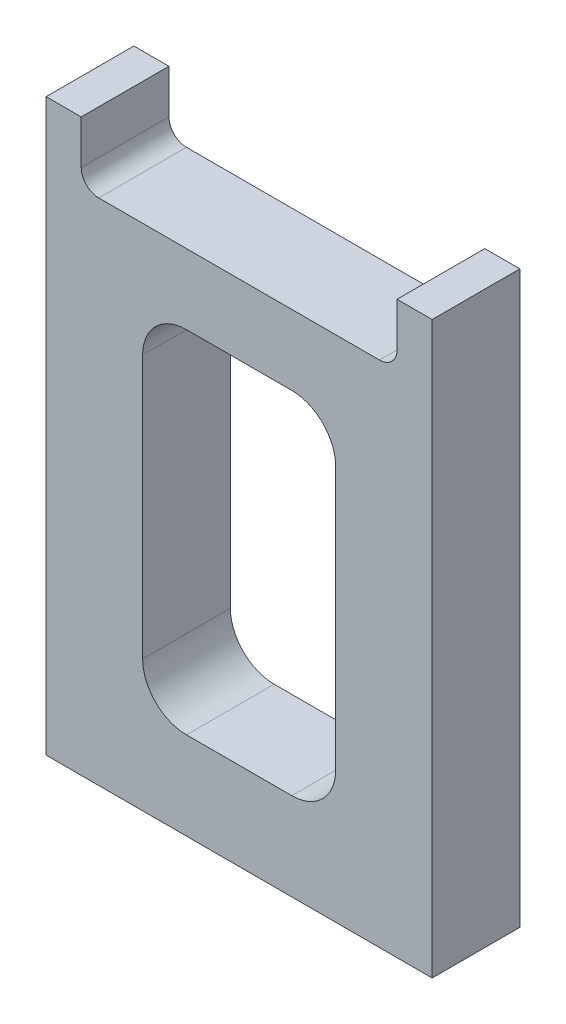
ISO-10303-21;
HEADER;
FILE_DESCRIPTION(('STEP AP214'),'2;1');
FILE_NAME('part.step','',(''),(''),'','','');
FILE_SCHEMA(('AUTOMOTIVE_DESIGN { 1 0 10303 214 1 1 1 1 }'));
ENDSEC;
DATA;
#1=APPLICATION_CONTEXT('core data for automotive mechanical design processes');
#2=APPLICATION_PROTOCOL_DEFINITION('international standard','automotive_design',2000,#1);
#3=PRODUCT_CONTEXT('',#1,'mechanical');
#4=PRODUCT('Part','Part','',(#3));
#5=PRODUCT_RELATED_PRODUCT_CATEGORY('part','',(#4));
#6=PRODUCT_DEFINITION_FORMATION('','',#4);
#7=PRODUCT_DEFINITION_CONTEXT('part definition',#1,'design');
#8=PRODUCT_DEFINITION('design','',#6,#7);
#9=PRODUCT_DEFINITION_SHAPE('','',#8);
#10=(LENGTH_UNIT() NAMED_UNIT(*) SI_UNIT(.MILLI.,.METRE.));
#11=(NAMED_UNIT(*) PLANE_ANGLE_UNIT() SI_UNIT($,.RADIAN.));
#12=(NAMED_UNIT(*) SI_UNIT($,.STERADIAN.) SOLID_ANGLE_UNIT());
#13=UNCERTAINTY_MEASURE_WITH_UNIT(LENGTH_MEASURE(1.E-05),#10,'distance_accuracy_value','');
#14=(GEOMETRIC_REPRESENTATION_CONTEXT(3) GLOBAL_UNCERTAINTY_ASSIGNED_CONTEXT((#13)) GLOBAL_UNIT_ASSIGNED_CONTEXT((#10,
#11,#12)) REPRESENTATION_CONTEXT('',''));
#15=CARTESIAN_POINT('',(0.,0.,0.));
#16=DIRECTION('',(0.,0.,1.));
#17=DIRECTION('',(1.,0.,0.));
#18=AXIS2_PLACEMENT_3D('',#15,#16,#17);
#19=CARTESIAN_POINT('',(22.,0.,10.));
#20=DIRECTION('',(-1.,0.,0.));
#21=DIRECTION('',(0.,0.,1.));
#22=AXIS2_PLACEMENT_3D('',#19,#20,#21);
#23=PLANE('',#22);
#24=DIRECTION('',(0.,1.,0.));
#25=VECTOR('',#24,1.);
#26=CARTESIAN_POINT('',(22.,0.,0.));
#27=LINE('',#26,#25);
#28=CARTESIAN_POINT('',(22.,0.,0.));
#29=VERTEX_POINT('',#28);
#30=CARTESIAN_POINT('',(22.,65.,0.));
#31=VERTEX_POINT('',#30);
#32=EDGE_CURVE('E182',#29,#31,#27,.T.);
#33=ORIENTED_EDGE('',*,*,#32,.T.);
#34=DIRECTION('',(0.,0.,-1.));
#35=VECTOR('',#34,1.);
#36=CARTESIAN_POINT('',(22.,65.,10.));
#37=LINE('',#36,#35);
#38=CARTESIAN_POINT('',(22.,65.,10.));
#39=VERTEX_POINT('',#38);
#40=EDGE_CURVE('E162',#39,#31,#37,.T.);
#41=ORIENTED_EDGE('',*,*,#40,.F.);
#42=DIRECTION('',(0.,1.,0.));
#43=VECTOR('',#42,1.);
#44=CARTESIAN_POINT('',(22.,0.,10.));
#45=LINE('',#44,#43);
#46=CARTESIAN_POINT('',(22.,0.,10.));
#47=VERTEX_POINT('',#46);
#48=EDGE_CURVE('E170',#47,#39,#45,.T.);
#49=ORIENTED_EDGE('',*,*,#48,.F.);
#50=DIRECTION('',(0.,0.,-1.));
#51=VECTOR('',#50,1.);
#52=CARTESIAN_POINT('',(22.,0.,10.));
#53=LINE('',#52,#51);
#54=EDGE_CURVE('E299',#47,#29,#53,.T.);
#55=ORIENTED_EDGE('',*,*,#54,.T.);
#56=EDGE_LOOP('',(#33,#41,#49,#55));
#57=FACE_BOUND('',#56,.T.);
#58=ADVANCED_FACE('F32',(#57),#23,.F.);
#59=CARTESIAN_POINT('',(22.,65.,10.));
#60=DIRECTION('',(0.,-1.,0.));
#61=DIRECTION('',(0.,0.,-1.));
#62=AXIS2_PLACEMENT_3D('',#59,#60,#61);
#63=PLANE('',#62);
#64=DIRECTION('',(-1.,0.,0.));
#65=VECTOR('',#64,1.);
#66=CARTESIAN_POINT('',(22.,65.,0.));
#67=LINE('',#66,#65);
#68=CARTESIAN_POINT('',(18.,65.,0.));
#69=VERTEX_POINT('',#68);
#70=EDGE_CURVE('E301',#31,#69,#67,.T.);
#71=ORIENTED_EDGE('',*,*,#70,.T.);
#72=DIRECTION('',(0.,0.,-1.));
#73=VECTOR('',#72,1.);
#74=CARTESIAN_POINT('',(18.,65.,10.));
#75=LINE('',#74,#73);
#76=CARTESIAN_POINT('',(18.,65.,10.));
#77=VERTEX_POINT('',#76);
#78=EDGE_CURVE('E165',#77,#69,#75,.T.);
#79=ORIENTED_EDGE('',*,*,#78,.F.);
#80=DIRECTION('',(-1.,0.,0.));
#81=VECTOR('',#80,1.);
#82=CARTESIAN_POINT('',(22.,65.,10.));
#83=LINE('',#82,#81);
#84=EDGE_CURVE('E158',#39,#77,#83,.T.);
#85=ORIENTED_EDGE('',*,*,#84,.F.);
#86=ORIENTED_EDGE('',*,*,#40,.T.);
#87=EDGE_LOOP('',(#71,#79,#85,#86));
#88=FACE_BOUND('',#87,.T.);
#89=ADVANCED_FACE('F160',(#88),#63,.F.);
#90=CARTESIAN_POINT('',(18.,65.,10.));
#91=DIRECTION('',(1.,0.,0.));
#92=DIRECTION('',(0.,0.,-1.));
#93=AXIS2_PLACEMENT_3D('',#90,#91,#92);
#94=PLANE('',#93);
#95=DIRECTION('',(0.,-1.,0.));
#96=VECTOR('',#95,1.);
#97=CARTESIAN_POINT('',(18.,65.,0.));
#98=LINE('',#97,#96);
#99=CARTESIAN_POINT('',(18.,60.,0.));
#100=VERTEX_POINT('',#99);
#101=EDGE_CURVE('E303',#69,#100,#98,.T.);
#102=ORIENTED_EDGE('',*,*,#101,.T.);
#103=DIRECTION('',(0.,0.,-1.));
#104=VECTOR('',#103,1.);
#105=CARTESIAN_POINT('',(18.,60.,10.));
#106=LINE('',#105,#104);
#107=CARTESIAN_POINT('',(18.,60.,10.));
#108=VERTEX_POINT('',#107);
#109=EDGE_CURVE('E193',#100,#108,#106,.F.);
#110=ORIENTED_EDGE('',*,*,#109,.T.);
#111=DIRECTION('',(0.,-1.,0.));
#112=VECTOR('',#111,1.);
#113=CARTESIAN_POINT('',(18.,65.,10.));
#114=LINE('',#113,#112);
#115=EDGE_CURVE('E169',#77,#108,#114,.T.);
#116=ORIENTED_EDGE('',*,*,#115,.F.);
#117=ORIENTED_EDGE('',*,*,#78,.T.);
#118=EDGE_LOOP('',(#102,#110,#116,#117));
#119=FACE_BOUND('',#118,.T.);
#120=ADVANCED_FACE('F342',(#119),#94,.F.);
#121=CARTESIAN_POINT('',(18.,58.,10.));
#122=DIRECTION('',(0.,-1.,0.));
#123=DIRECTION('',(0.,0.,-1.));
#124=AXIS2_PLACEMENT_3D('',#121,#122,#123);
#125=PLANE('',#124);
#126=DIRECTION('',(-1.,0.,0.));
#127=VECTOR('',#126,1.);
#128=CARTESIAN_POINT('',(18.,58.,10.));
#129=LINE('',#128,#127);
#130=CARTESIAN_POINT('',(16.,58.,10.));
#131=VERTEX_POINT('',#130);
#132=CARTESIAN_POINT('',(-16.,58.,10.));
#133=VERTEX_POINT('',#132);
#134=EDGE_CURVE('E289',#131,#133,#129,.T.);
#135=ORIENTED_EDGE('',*,*,#134,.F.);
#136=DIRECTION('',(0.,0.,-1.));
#137=VECTOR('',#136,1.);
#138=CARTESIAN_POINT('',(16.,58.,0.));
#139=LINE('',#138,#137);
#140=CARTESIAN_POINT('',(16.,58.,0.));
#141=VERTEX_POINT('',#140);
#142=EDGE_CURVE('E185',#131,#141,#139,.T.);
#143=ORIENTED_EDGE('',*,*,#142,.T.);
#144=DIRECTION('',(-1.,0.,0.));
#145=VECTOR('',#144,1.);
#146=CARTESIAN_POINT('',(18.,58.,0.));
#147=LINE('',#146,#145);
#148=CARTESIAN_POINT('',(-16.,58.,0.));
#149=VERTEX_POINT('',#148);
#150=EDGE_CURVE('E306',#141,#149,#147,.T.);
#151=ORIENTED_EDGE('',*,*,#150,.T.);
#152=DIRECTION('',(0.,0.,-1.));
#153=VECTOR('',#152,1.);
#154=CARTESIAN_POINT('',(-16.,58.,10.));
#155=LINE('',#154,#153);
#156=EDGE_CURVE('E183',#149,#133,#155,.F.);
#157=ORIENTED_EDGE('',*,*,#156,.T.);
#158=EDGE_LOOP('',(#135,#143,#151,#157));
#159=FACE_BOUND('',#158,.T.);
#160=ADVANCED_FACE('F351',(#159),#125,.F.);
#161=CARTESIAN_POINT('',(-18.,65.,10.));
#162=DIRECTION('',(-1.,0.,0.));
#163=DIRECTION('',(0.,0.,1.));
#164=AXIS2_PLACEMENT_3D('',#161,#162,#163);
#165=PLANE('',#164);
#166=DIRECTION('',(0.,1.,0.));
#167=VECTOR('',#166,1.);
#168=CARTESIAN_POINT('',(-18.,65.,10.));
#169=LINE('',#168,#167);
#170=CARTESIAN_POINT('',(-18.,60.,10.));
#171=VERTEX_POINT('',#170);
#172=CARTESIAN_POINT('',(-18.,65.,10.));
#173=VERTEX_POINT('',#172);
#174=EDGE_CURVE('E292',#171,#173,#169,.T.);
#175=ORIENTED_EDGE('',*,*,#174,.F.);
#176=DIRECTION('',(0.,0.,-1.));
#177=VECTOR('',#176,1.);
#178=CARTESIAN_POINT('',(-18.,60.,0.));
#179=LINE('',#178,#177);
#180=CARTESIAN_POINT('',(-18.,60.,0.));
#181=VERTEX_POINT('',#180);
#182=EDGE_CURVE('E195',#171,#181,#179,.T.);
#183=ORIENTED_EDGE('',*,*,#182,.T.);
#184=DIRECTION('',(0.,1.,0.));
#185=VECTOR('',#184,1.);
#186=CARTESIAN_POINT('',(-18.,65.,0.));
#187=LINE('',#186,#185);
#188=CARTESIAN_POINT('',(-18.,65.,0.));
#189=VERTEX_POINT('',#188);
#190=EDGE_CURVE('E309',#181,#189,#187,.T.);
#191=ORIENTED_EDGE('',*,*,#190,.T.);
#192=DIRECTION('',(0.,0.,-1.));
#193=VECTOR('',#192,1.);
#194=CARTESIAN_POINT('',(-18.,65.,10.));
#195=LINE('',#194,#193);
#196=EDGE_CURVE('E187',#173,#189,#195,.T.);
#197=ORIENTED_EDGE('',*,*,#196,.F.);
#198=EDGE_LOOP('',(#175,#183,#191,#197));
#199=FACE_BOUND('',#198,.T.);
#200=ADVANCED_FACE('F357',(#199),#165,.F.);
#201=CARTESIAN_POINT('',(-22.,65.,10.));
#202=DIRECTION('',(0.,-1.,0.));
#203=DIRECTION('',(0.,0.,-1.));
#204=AXIS2_PLACEMENT_3D('',#201,#202,#203);
#205=PLANE('',#204);
#206=DIRECTION('',(-1.,0.,0.));
#207=VECTOR('',#206,1.);
#208=CARTESIAN_POINT('',(-22.,65.,0.));
#209=LINE('',#208,#207);
#210=CARTESIAN_POINT('',(-22.,65.,0.));
#211=VERTEX_POINT('',#210);
#212=EDGE_CURVE('E311',#189,#211,#209,.T.);
#213=ORIENTED_EDGE('',*,*,#212,.T.);
#214=DIRECTION('',(0.,0.,-1.));
#215=VECTOR('',#214,1.);
#216=CARTESIAN_POINT('',(-22.,65.,10.));
#217=LINE('',#216,#215);
#218=CARTESIAN_POINT('',(-22.,65.,10.));
#219=VERTEX_POINT('',#218);
#220=EDGE_CURVE('E320',#219,#211,#217,.T.);
#221=ORIENTED_EDGE('',*,*,#220,.F.);
#222=DIRECTION('',(-1.,0.,0.));
#223=VECTOR('',#222,1.);
#224=CARTESIAN_POINT('',(-22.,65.,10.));
#225=LINE('',#224,#223);
#226=EDGE_CURVE('E294',#173,#219,#225,.T.);
#227=ORIENTED_EDGE('',*,*,#226,.F.);
#228=ORIENTED_EDGE('',*,*,#196,.T.);
#229=EDGE_LOOP('',(#213,#221,#227,#228));
#230=FACE_BOUND('',#229,.T.);
#231=ADVANCED_FACE('F327',(#230),#205,.F.);
#232=CARTESIAN_POINT('',(-22.,0.,10.));
#233=DIRECTION('',(1.,0.,0.));
#234=DIRECTION('',(0.,0.,-1.));
#235=AXIS2_PLACEMENT_3D('',#232,#233,#234);
#236=PLANE('',#235);
#237=DIRECTION('',(0.,-1.,0.));
#238=VECTOR('',#237,1.);
#239=CARTESIAN_POINT('',(-22.,0.,0.));
#240=LINE('',#239,#238);
#241=CARTESIAN_POINT('',(-22.,0.,0.));
#242=VERTEX_POINT('',#241);
#243=EDGE_CURVE('E313',#211,#242,#240,.T.);
#244=ORIENTED_EDGE('',*,*,#243,.T.);
#245=DIRECTION('',(0.,0.,-1.));
#246=VECTOR('',#245,1.);
#247=CARTESIAN_POINT('',(-22.,0.,10.));
#248=LINE('',#247,#246);
#249=CARTESIAN_POINT('',(-22.,0.,10.));
#250=VERTEX_POINT('',#249);
#251=EDGE_CURVE('E317',#250,#242,#248,.T.);
#252=ORIENTED_EDGE('',*,*,#251,.F.);
#253=DIRECTION('',(0.,-1.,0.));
#254=VECTOR('',#253,1.);
#255=CARTESIAN_POINT('',(-22.,0.,10.));
#256=LINE('',#255,#254);
#257=EDGE_CURVE('E296',#219,#250,#256,.T.);
#258=ORIENTED_EDGE('',*,*,#257,.F.);
#259=ORIENTED_EDGE('',*,*,#220,.T.);
#260=EDGE_LOOP('',(#244,#252,#258,#259));
#261=FACE_BOUND('',#260,.T.);
#262=ADVANCED_FACE('F336',(#261),#236,.F.);
#263=CARTESIAN_POINT('',(-22.,0.,10.));
#264=DIRECTION('',(0.,1.,0.));
#265=DIRECTION('',(0.,0.,1.));
#266=AXIS2_PLACEMENT_3D('',#263,#264,#265);
#267=PLANE('',#266);
#268=CARTESIAN_POINT('',(-15.,0.,5.));
#269=DIRECTION('',(0.,-1.,0.));
#270=DIRECTION('',(0.,0.,1.));
#271=AXIS2_PLACEMENT_3D('',#268,#269,#270);
#272=CIRCLE('',#271,2.);
#273=CARTESIAN_POINT('',(-15.,0.,7.));
#274=VERTEX_POINT('',#273);
#275=EDGE_CURVE('E271',#274,#274,#272,.T.);
#276=ORIENTED_EDGE('',*,*,#275,.F.);
#277=EDGE_LOOP('',(#276));
#278=FACE_BOUND('',#277,.T.);
#279=CARTESIAN_POINT('',(15.,0.,5.));
#280=DIRECTION('',(0.,-1.,0.));
#281=DIRECTION('',(0.,0.,-1.));
#282=AXIS2_PLACEMENT_3D('',#279,#280,#281);
#283=CIRCLE('',#282,2.);
#284=CARTESIAN_POINT('',(15.,0.,3.));
#285=VERTEX_POINT('',#284);
#286=EDGE_CURVE('E280',#285,#285,#283,.T.);
#287=ORIENTED_EDGE('',*,*,#286,.F.);
#288=EDGE_LOOP('',(#287));
#289=FACE_BOUND('',#288,.T.);
#290=DIRECTION('',(1.,0.,0.));
#291=VECTOR('',#290,1.);
#292=CARTESIAN_POINT('',(-22.,0.,0.));
#293=LINE('',#292,#291);
#294=EDGE_CURVE('E179',#242,#29,#293,.T.);
#295=ORIENTED_EDGE('',*,*,#294,.T.);
#296=ORIENTED_EDGE('',*,*,#54,.F.);
#297=DIRECTION('',(1.,0.,0.));
#298=VECTOR('',#297,1.);
#299=CARTESIAN_POINT('',(-22.,0.,10.));
#300=LINE('',#299,#298);
#301=EDGE_CURVE('E175',#250,#47,#300,.T.);
#302=ORIENTED_EDGE('',*,*,#301,.F.);
#303=ORIENTED_EDGE('',*,*,#251,.T.);
#304=EDGE_LOOP('',(#295,#296,#302,#303));
#305=FACE_BOUND('',#304,.T.);
#306=ADVANCED_FACE('F339',(#278,#289,#305),#267,.F.);
#307=CARTESIAN_POINT('',(0.,0.,10.));
#308=DIRECTION('',(0.,0.,1.));
#309=DIRECTION('',(1.,0.,0.));
#310=AXIS2_PLACEMENT_3D('',#307,#308,#309);
#311=PLANE('',#310);
#312=DIRECTION('',(1.,0.,0.));
#313=VECTOR('',#312,1.);
#314=CARTESIAN_POINT('',(11.,50.,10.));
#315=LINE('',#314,#313);
#316=CARTESIAN_POINT('',(-6.,50.,10.));
#317=VERTEX_POINT('',#316);
#318=CARTESIAN_POINT('',(6.,50.,10.));
#319=VERTEX_POINT('',#318);
#320=EDGE_CURVE('E260',#317,#319,#315,.T.);
#321=ORIENTED_EDGE('',*,*,#320,.T.);
#322=CARTESIAN_POINT('',(6.,45.,10.));
#323=DIRECTION('',(0.,0.,1.));
#324=DIRECTION('',(1.,0.,0.));
#325=AXIS2_PLACEMENT_3D('',#322,#323,#324);
#326=CIRCLE('',#325,5.);
#327=CARTESIAN_POINT('',(11.,45.,10.));
#328=VERTEX_POINT('',#327);
#329=EDGE_CURVE('E11',#319,#328,#326,.F.);
#330=ORIENTED_EDGE('',*,*,#329,.T.);
#331=DIRECTION('',(0.,-1.,0.));
#332=VECTOR('',#331,1.);
#333=CARTESIAN_POINT('',(11.,50.,10.));
#334=LINE('',#333,#332);
#335=CARTESIAN_POINT('',(11.,15.,10.));
#336=VERTEX_POINT('',#335);
#337=EDGE_CURVE('E253',#328,#336,#334,.T.);
#338=ORIENTED_EDGE('',*,*,#337,.T.);
#339=CARTESIAN_POINT('',(6.,15.,10.));
#340=DIRECTION('',(0.,0.,1.));
#341=DIRECTION('',(1.,0.,0.));
#342=AXIS2_PLACEMENT_3D('',#339,#340,#341);
#343=CIRCLE('',#342,5.);
#344=CARTESIAN_POINT('',(6.,10.,10.));
#345=VERTEX_POINT('',#344);
#346=EDGE_CURVE('E227',#336,#345,#343,.F.);
#347=ORIENTED_EDGE('',*,*,#346,.T.);
#348=DIRECTION('',(-1.,0.,0.));
#349=VECTOR('',#348,1.);
#350=CARTESIAN_POINT('',(11.,10.,10.));
#351=LINE('',#350,#349);
#352=CARTESIAN_POINT('',(-6.,10.,10.));
#353=VERTEX_POINT('',#352);
#354=EDGE_CURVE('E264',#345,#353,#351,.T.);
#355=ORIENTED_EDGE('',*,*,#354,.T.);
#356=CARTESIAN_POINT('',(-6.,15.,10.));
#357=DIRECTION('',(0.,0.,1.));
#358=DIRECTION('',(1.,0.,0.));
#359=AXIS2_PLACEMENT_3D('',#356,#357,#358);
#360=CIRCLE('',#359,5.);
#361=CARTESIAN_POINT('',(-11.,15.,10.));
#362=VERTEX_POINT('',#361);
#363=EDGE_CURVE('E54',#353,#362,#360,.F.);
#364=ORIENTED_EDGE('',*,*,#363,.T.);
#365=DIRECTION('',(0.,1.,0.));
#366=VECTOR('',#365,1.);
#367=CARTESIAN_POINT('',(-11.,50.,10.));
#368=LINE('',#367,#366);
#369=CARTESIAN_POINT('',(-11.,45.,10.));
#370=VERTEX_POINT('',#369);
#371=EDGE_CURVE('E266',#362,#370,#368,.T.);
#372=ORIENTED_EDGE('',*,*,#371,.T.);
#373=CARTESIAN_POINT('',(-6.,45.,10.));
#374=DIRECTION('',(0.,0.,1.));
#375=DIRECTION('',(1.,0.,0.));
#376=AXIS2_PLACEMENT_3D('',#373,#374,#375);
#377=CIRCLE('',#376,5.);
#378=EDGE_CURVE('E231',#370,#317,#377,.F.);
#379=ORIENTED_EDGE('',*,*,#378,.T.);
#380=EDGE_LOOP('',(#321,#330,#338,#347,#355,#364,#372,#379));
#381=FACE_BOUND('',#380,.T.);
#382=ORIENTED_EDGE('',*,*,#48,.T.);
#383=ORIENTED_EDGE('',*,*,#84,.T.);
#384=ORIENTED_EDGE('',*,*,#115,.T.);
#385=CARTESIAN_POINT('',(16.,60.,10.));
#386=DIRECTION('',(0.,0.,1.));
#387=DIRECTION('',(1.,0.,0.));
#388=AXIS2_PLACEMENT_3D('',#385,#386,#387);
#389=CIRCLE('',#388,2.);
#390=EDGE_CURVE('E200',#108,#131,#389,.F.);
#391=ORIENTED_EDGE('',*,*,#390,.T.);
#392=ORIENTED_EDGE('',*,*,#134,.T.);
#393=CARTESIAN_POINT('',(-16.,60.,10.));
#394=DIRECTION('',(0.,0.,1.));
#395=DIRECTION('',(1.,0.,0.));
#396=AXIS2_PLACEMENT_3D('',#393,#394,#395);
#397=CIRCLE('',#396,2.);
#398=EDGE_CURVE('E204',#133,#171,#397,.F.);
#399=ORIENTED_EDGE('',*,*,#398,.T.);
#400=ORIENTED_EDGE('',*,*,#174,.T.);
#401=ORIENTED_EDGE('',*,*,#226,.T.);
#402=ORIENTED_EDGE('',*,*,#257,.T.);
#403=ORIENTED_EDGE('',*,*,#301,.T.);
#404=EDGE_LOOP('',(#382,#383,#384,#391,#392,#399,#400,#401,#402,#403));
#405=FACE_BOUND('',#404,.T.);
#406=ADVANCED_FACE('F173',(#381,#405),#311,.T.);
#407=CARTESIAN_POINT('',(0.,0.,0.));
#408=DIRECTION('',(0.,0.,1.));
#409=DIRECTION('',(1.,0.,0.));
#410=AXIS2_PLACEMENT_3D('',#407,#408,#409);
#411=PLANE('',#410);
#412=DIRECTION('',(-1.,0.,0.));
#413=VECTOR('',#412,1.);
#414=CARTESIAN_POINT('',(11.,10.,0.));
#415=LINE('',#414,#413);
#416=CARTESIAN_POINT('',(6.,10.,0.));
#417=VERTEX_POINT('',#416);
#418=CARTESIAN_POINT('',(-6.,10.,0.));
#419=VERTEX_POINT('',#418);
#420=EDGE_CURVE('E273',#417,#419,#415,.T.);
#421=ORIENTED_EDGE('',*,*,#420,.F.);
#422=CARTESIAN_POINT('',(6.,15.,0.));
#423=DIRECTION('',(0.,0.,1.));
#424=DIRECTION('',(1.,0.,0.));
#425=AXIS2_PLACEMENT_3D('',#422,#423,#424);
#426=CIRCLE('',#425,5.);
#427=CARTESIAN_POINT('',(11.,15.,0.));
#428=VERTEX_POINT('',#427);
#429=EDGE_CURVE('E225',#417,#428,#426,.T.);
#430=ORIENTED_EDGE('',*,*,#429,.T.);
#431=DIRECTION('',(0.,-1.,0.));
#432=VECTOR('',#431,1.);
#433=CARTESIAN_POINT('',(11.,50.,0.));
#434=LINE('',#433,#432);
#435=CARTESIAN_POINT('',(11.,45.,0.));
#436=VERTEX_POINT('',#435);
#437=EDGE_CURVE('E244',#436,#428,#434,.T.);
#438=ORIENTED_EDGE('',*,*,#437,.F.);
#439=CARTESIAN_POINT('',(6.,45.,0.));
#440=DIRECTION('',(0.,0.,1.));
#441=DIRECTION('',(1.,0.,0.));
#442=AXIS2_PLACEMENT_3D('',#439,#440,#441);
#443=CIRCLE('',#442,5.);
#444=CARTESIAN_POINT('',(6.,50.,0.));
#445=VERTEX_POINT('',#444);
#446=EDGE_CURVE('E40',#436,#445,#443,.T.);
#447=ORIENTED_EDGE('',*,*,#446,.T.);
#448=DIRECTION('',(1.,0.,0.));
#449=VECTOR('',#448,1.);
#450=CARTESIAN_POINT('',(11.,50.,0.));
#451=LINE('',#450,#449);
#452=CARTESIAN_POINT('',(-6.,50.,0.));
#453=VERTEX_POINT('',#452);
#454=EDGE_CURVE('E242',#453,#445,#451,.T.);
#455=ORIENTED_EDGE('',*,*,#454,.F.);
#456=CARTESIAN_POINT('',(-6.,45.,0.));
#457=DIRECTION('',(0.,0.,1.));
#458=DIRECTION('',(1.,0.,0.));
#459=AXIS2_PLACEMENT_3D('',#456,#457,#458);
#460=CIRCLE('',#459,5.);
#461=CARTESIAN_POINT('',(-11.,45.,0.));
#462=VERTEX_POINT('',#461);
#463=EDGE_CURVE('E229',#453,#462,#460,.T.);
#464=ORIENTED_EDGE('',*,*,#463,.T.);
#465=DIRECTION('',(0.,1.,0.));
#466=VECTOR('',#465,1.);
#467=CARTESIAN_POINT('',(-11.,50.,0.));
#468=LINE('',#467,#466);
#469=CARTESIAN_POINT('',(-11.,15.,0.));
#470=VERTEX_POINT('',#469);
#471=EDGE_CURVE('E254',#470,#462,#468,.T.);
#472=ORIENTED_EDGE('',*,*,#471,.F.);
#473=CARTESIAN_POINT('',(-6.,15.,0.));
#474=DIRECTION('',(0.,0.,1.));
#475=DIRECTION('',(1.,0.,0.));
#476=AXIS2_PLACEMENT_3D('',#473,#474,#475);
#477=CIRCLE('',#476,5.);
#478=EDGE_CURVE('E233',#470,#419,#477,.T.);
#479=ORIENTED_EDGE('',*,*,#478,.T.);
#480=EDGE_LOOP('',(#421,#430,#438,#447,#455,#464,#472,#479));
#481=FACE_BOUND('',#480,.T.);
#482=ORIENTED_EDGE('',*,*,#32,.F.);
#483=ORIENTED_EDGE('',*,*,#294,.F.);
#484=ORIENTED_EDGE('',*,*,#243,.F.);
#485=ORIENTED_EDGE('',*,*,#212,.F.);
#486=ORIENTED_EDGE('',*,*,#190,.F.);
#487=CARTESIAN_POINT('',(-16.,60.,0.));
#488=DIRECTION('',(0.,0.,1.));
#489=DIRECTION('',(1.,0.,0.));
#490=AXIS2_PLACEMENT_3D('',#487,#488,#489);
#491=CIRCLE('',#490,2.);
#492=EDGE_CURVE('E202',#181,#149,#491,.T.);
#493=ORIENTED_EDGE('',*,*,#492,.T.);
#494=ORIENTED_EDGE('',*,*,#150,.F.);
#495=CARTESIAN_POINT('',(16.,60.,0.));
#496=DIRECTION('',(0.,0.,1.));
#497=DIRECTION('',(1.,0.,0.));
#498=AXIS2_PLACEMENT_3D('',#495,#496,#497);
#499=CIRCLE('',#498,2.);
#500=EDGE_CURVE('E198',#141,#100,#499,.T.);
#501=ORIENTED_EDGE('',*,*,#500,.T.);
#502=ORIENTED_EDGE('',*,*,#101,.F.);
#503=ORIENTED_EDGE('',*,*,#70,.F.);
#504=EDGE_LOOP('',(#482,#483,#484,#485,#486,#493,#494,#501,#502,#503));
#505=FACE_BOUND('',#504,.T.);
#506=ADVANCED_FACE('F240',(#481,#505),#411,.F.);
#507=CARTESIAN_POINT('',(15.,10.,5.));
#508=DIRECTION('',(0.,-1.,0.));
#509=DIRECTION('',(0.,0.,-1.));
#510=AXIS2_PLACEMENT_3D('',#507,#508,#509);
#511=CYLINDRICAL_SURFACE('',#510,2.);
#512=CARTESIAN_POINT('',(15.,10.,5.));
#513=DIRECTION('',(0.,-1.,0.));
#514=DIRECTION('',(0.,0.,-1.));
#515=AXIS2_PLACEMENT_3D('',#512,#513,#514);
#516=CIRCLE('',#515,2.);
#517=CARTESIAN_POINT('',(15.,10.,3.));
#518=VERTEX_POINT('',#517);
#519=EDGE_CURVE('E283',#518,#518,#516,.T.);
#520=ORIENTED_EDGE('',*,*,#519,.F.);
#521=EDGE_LOOP('',(#520));
#522=FACE_BOUND('',#521,.T.);
#523=ORIENTED_EDGE('',*,*,#286,.T.);
#524=EDGE_LOOP('',(#523));
#525=FACE_BOUND('',#524,.T.);
#526=ADVANCED_FACE('F421',(#522,#525),#511,.F.);
#527=CARTESIAN_POINT('',(15.,10.,5.));
#528=DIRECTION('',(0.,-1.,0.));
#529=DIRECTION('',(0.,0.,-1.));
#530=AXIS2_PLACEMENT_3D('',#527,#528,#529);
#531=PLANE('',#530);
#532=ORIENTED_EDGE('',*,*,#519,.T.);
#533=EDGE_LOOP('',(#532));
#534=FACE_BOUND('',#533,.T.);
#535=ADVANCED_FACE('F417',(#534),#531,.T.);
#536=CARTESIAN_POINT('',(-15.,10.,5.));
#537=DIRECTION('',(0.,-1.,0.));
#538=DIRECTION('',(0.,0.,-1.));
#539=AXIS2_PLACEMENT_3D('',#536,#537,#538);
#540=CYLINDRICAL_SURFACE('',#539,2.);
#541=CARTESIAN_POINT('',(-15.,10.,5.));
#542=DIRECTION('',(0.,-1.,0.));
#543=DIRECTION('',(0.,0.,1.));
#544=AXIS2_PLACEMENT_3D('',#541,#542,#543);
#545=CIRCLE('',#544,2.);
#546=CARTESIAN_POINT('',(-15.,10.,7.));
#547=VERTEX_POINT('',#546);
#548=EDGE_CURVE('E277',#547,#547,#545,.T.);
#549=ORIENTED_EDGE('',*,*,#548,.F.);
#550=EDGE_LOOP('',(#549));
#551=FACE_BOUND('',#550,.T.);
#552=ORIENTED_EDGE('',*,*,#275,.T.);
#553=EDGE_LOOP('',(#552));
#554=FACE_BOUND('',#553,.T.);
#555=ADVANCED_FACE('F413',(#551,#554),#540,.F.);
#556=CARTESIAN_POINT('',(-15.,10.,5.));
#557=DIRECTION('',(0.,1.,0.));
#558=DIRECTION('',(0.,0.,1.));
#559=AXIS2_PLACEMENT_3D('',#556,#557,#558);
#560=PLANE('',#559);
#561=ORIENTED_EDGE('',*,*,#548,.T.);
#562=EDGE_LOOP('',(#561));
#563=FACE_BOUND('',#562,.T.);
#564=ADVANCED_FACE('F376',(#563),#560,.F.);
#565=CARTESIAN_POINT('',(16.,60.,10.));
#566=DIRECTION('',(0.,0.,1.));
#567=DIRECTION('',(1.,0.,0.));
#568=AXIS2_PLACEMENT_3D('',#565,#566,#567);
#569=CYLINDRICAL_SURFACE('',#568,2.);
#570=ORIENTED_EDGE('',*,*,#390,.F.);
#571=ORIENTED_EDGE('',*,*,#109,.F.);
#572=ORIENTED_EDGE('',*,*,#500,.F.);
#573=ORIENTED_EDGE('',*,*,#142,.F.);
#574=EDGE_LOOP('',(#570,#571,#572,#573));
#575=FACE_BOUND('',#574,.T.);
#576=ADVANCED_FACE('F348',(#575),#569,.F.);
#577=CARTESIAN_POINT('',(-16.,60.,10.));
#578=DIRECTION('',(0.,0.,1.));
#579=DIRECTION('',(1.,0.,0.));
#580=AXIS2_PLACEMENT_3D('',#577,#578,#579);
#581=CYLINDRICAL_SURFACE('',#580,2.);
#582=ORIENTED_EDGE('',*,*,#398,.F.);
#583=ORIENTED_EDGE('',*,*,#156,.F.);
#584=ORIENTED_EDGE('',*,*,#492,.F.);
#585=ORIENTED_EDGE('',*,*,#182,.F.);
#586=EDGE_LOOP('',(#582,#583,#584,#585));
#587=FACE_BOUND('',#586,.T.);
#588=ADVANCED_FACE('F356',(#587),#581,.F.);
#589=CARTESIAN_POINT('',(11.,50.,10.));
#590=DIRECTION('',(1.,0.,0.));
#591=DIRECTION('',(0.,1.,0.));
#592=AXIS2_PLACEMENT_3D('',#589,#590,#591);
#593=PLANE('',#592);
#594=ORIENTED_EDGE('',*,*,#437,.T.);
#595=DIRECTION('',(0.,0.,-1.));
#596=VECTOR('',#595,1.);
#597=CARTESIAN_POINT('',(11.,15.,10.));
#598=LINE('',#597,#596);
#599=EDGE_CURVE('E214',#428,#336,#598,.F.);
#600=ORIENTED_EDGE('',*,*,#599,.T.);
#601=ORIENTED_EDGE('',*,*,#337,.F.);
#602=DIRECTION('',(0.,0.,-1.));
#603=VECTOR('',#602,1.);
#604=CARTESIAN_POINT('',(11.,45.,0.));
#605=LINE('',#604,#603);
#606=EDGE_CURVE('E211',#328,#436,#605,.T.);
#607=ORIENTED_EDGE('',*,*,#606,.T.);
#608=EDGE_LOOP('',(#594,#600,#601,#607));
#609=FACE_BOUND('',#608,.T.);
#610=ADVANCED_FACE('F262',(#609),#593,.F.);
#611=CARTESIAN_POINT('',(11.,50.,10.));
#612=DIRECTION('',(0.,1.,0.));
#613=DIRECTION('',(0.,0.,1.));
#614=AXIS2_PLACEMENT_3D('',#611,#612,#613);
#615=PLANE('',#614);
#616=ORIENTED_EDGE('',*,*,#320,.F.);
#617=DIRECTION('',(0.,0.,-1.));
#618=VECTOR('',#617,1.);
#619=CARTESIAN_POINT('',(-6.,50.,0.));
#620=LINE('',#619,#618);
#621=EDGE_CURVE('E218',#317,#453,#620,.T.);
#622=ORIENTED_EDGE('',*,*,#621,.T.);
#623=ORIENTED_EDGE('',*,*,#454,.T.);
#624=DIRECTION('',(0.,0.,-1.));
#625=VECTOR('',#624,1.);
#626=CARTESIAN_POINT('',(6.,50.,10.));
#627=LINE('',#626,#625);
#628=EDGE_CURVE('E216',#445,#319,#627,.F.);
#629=ORIENTED_EDGE('',*,*,#628,.T.);
#630=EDGE_LOOP('',(#616,#622,#623,#629));
#631=FACE_BOUND('',#630,.T.);
#632=ADVANCED_FACE('F250',(#631),#615,.F.);
#633=CARTESIAN_POINT('',(-11.,50.,10.));
#634=DIRECTION('',(-1.,0.,0.));
#635=DIRECTION('',(0.,0.,1.));
#636=AXIS2_PLACEMENT_3D('',#633,#634,#635);
#637=PLANE('',#636);
#638=ORIENTED_EDGE('',*,*,#471,.T.);
#639=DIRECTION('',(0.,0.,-1.));
#640=VECTOR('',#639,1.);
#641=CARTESIAN_POINT('',(-11.,45.,10.));
#642=LINE('',#641,#640);
#643=EDGE_CURVE('E47',#462,#370,#642,.F.);
#644=ORIENTED_EDGE('',*,*,#643,.T.);
#645=ORIENTED_EDGE('',*,*,#371,.F.);
#646=DIRECTION('',(0.,0.,-1.));
#647=VECTOR('',#646,1.);
#648=CARTESIAN_POINT('',(-11.,15.,0.));
#649=LINE('',#648,#647);
#650=EDGE_CURVE('E221',#362,#470,#649,.T.);
#651=ORIENTED_EDGE('',*,*,#650,.T.);
#652=EDGE_LOOP('',(#638,#644,#645,#651));
#653=FACE_BOUND('',#652,.T.);
#654=ADVANCED_FACE('F396',(#653),#637,.F.);
#655=CARTESIAN_POINT('',(11.,10.,10.));
#656=DIRECTION('',(0.,-1.,0.));
#657=DIRECTION('',(0.,0.,-1.));
#658=AXIS2_PLACEMENT_3D('',#655,#656,#657);
#659=PLANE('',#658);
#660=ORIENTED_EDGE('',*,*,#354,.F.);
#661=DIRECTION('',(0.,0.,-1.));
#662=VECTOR('',#661,1.);
#663=CARTESIAN_POINT('',(6.,10.,0.));
#664=LINE('',#663,#662);
#665=EDGE_CURVE('E208',#345,#417,#664,.T.);
#666=ORIENTED_EDGE('',*,*,#665,.T.);
#667=ORIENTED_EDGE('',*,*,#420,.T.);
#668=DIRECTION('',(0.,0.,-1.));
#669=VECTOR('',#668,1.);
#670=CARTESIAN_POINT('',(-6.,10.,10.));
#671=LINE('',#670,#669);
#672=EDGE_CURVE('E206',#419,#353,#671,.F.);
#673=ORIENTED_EDGE('',*,*,#672,.T.);
#674=EDGE_LOOP('',(#660,#666,#667,#673));
#675=FACE_BOUND('',#674,.T.);
#676=ADVANCED_FACE('F383',(#675),#659,.F.);
#677=CARTESIAN_POINT('',(6.,15.,10.));
#678=DIRECTION('',(0.,0.,1.));
#679=DIRECTION('',(1.,0.,0.));
#680=AXIS2_PLACEMENT_3D('',#677,#678,#679);
#681=CYLINDRICAL_SURFACE('',#680,5.);
#682=ORIENTED_EDGE('',*,*,#346,.F.);
#683=ORIENTED_EDGE('',*,*,#599,.F.);
#684=ORIENTED_EDGE('',*,*,#429,.F.);
#685=ORIENTED_EDGE('',*,*,#665,.F.);
#686=EDGE_LOOP('',(#682,#683,#684,#685));
#687=FACE_BOUND('',#686,.T.);
#688=ADVANCED_FACE('F379',(#687),#681,.F.);
#689=CARTESIAN_POINT('',(-6.,45.,10.));
#690=DIRECTION('',(0.,0.,1.));
#691=DIRECTION('',(1.,0.,0.));
#692=AXIS2_PLACEMENT_3D('',#689,#690,#691);
#693=CYLINDRICAL_SURFACE('',#692,5.);
#694=ORIENTED_EDGE('',*,*,#378,.F.);
#695=ORIENTED_EDGE('',*,*,#643,.F.);
#696=ORIENTED_EDGE('',*,*,#463,.F.);
#697=ORIENTED_EDGE('',*,*,#621,.F.);
#698=EDGE_LOOP('',(#694,#695,#696,#697));
#699=FACE_BOUND('',#698,.T.);
#700=ADVANCED_FACE('F382',(#699),#693,.F.);
#701=CARTESIAN_POINT('',(-6.,15.,10.));
#702=DIRECTION('',(0.,0.,1.));
#703=DIRECTION('',(1.,0.,0.));
#704=AXIS2_PLACEMENT_3D('',#701,#702,#703);
#705=CYLINDRICAL_SURFACE('',#704,5.);
#706=ORIENTED_EDGE('',*,*,#363,.F.);
#707=ORIENTED_EDGE('',*,*,#672,.F.);
#708=ORIENTED_EDGE('',*,*,#478,.F.);
#709=ORIENTED_EDGE('',*,*,#650,.F.);
#710=EDGE_LOOP('',(#706,#707,#708,#709));
#711=FACE_BOUND('',#710,.T.);
#712=ADVANCED_FACE('F386',(#711),#705,.F.);
#713=CARTESIAN_POINT('',(6.,45.,10.));
#714=DIRECTION('',(0.,0.,1.));
#715=DIRECTION('',(1.,0.,0.));
#716=AXIS2_PLACEMENT_3D('',#713,#714,#715);
#717=CYLINDRICAL_SURFACE('',#716,5.);
#718=ORIENTED_EDGE('',*,*,#329,.F.);
#719=ORIENTED_EDGE('',*,*,#628,.F.);
#720=ORIENTED_EDGE('',*,*,#446,.F.);
#721=ORIENTED_EDGE('',*,*,#606,.F.);
#722=EDGE_LOOP('',(#718,#719,#720,#721));
#723=FACE_BOUND('',#722,.T.);
#724=ADVANCED_FACE('F34',(#723),#717,.F.);
#725=CLOSED_SHELL('',(#58,#89,#120,#160,#200,#231,#262,#306,#406,#506,#526,#535,#555,#564,#576,
#588,#610,#632,#654,#676,#688,#700,#712,#724));
#726=MANIFOLD_SOLID_BREP('B2',#725);
#727=ADVANCED_BREP_SHAPE_REPRESENTATION('',(#18,#726),#14);
#728=SHAPE_DEFINITION_REPRESENTATION(#9,#727);
ENDSEC;
END-ISO-10303-21;
